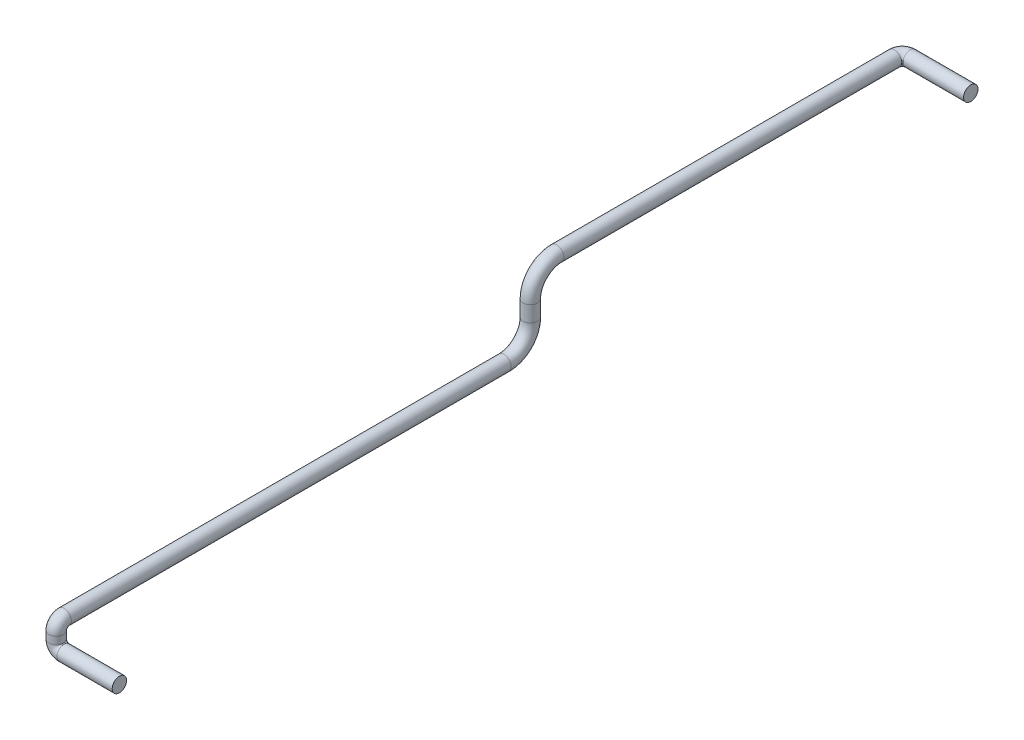
ISO-10303-21;
HEADER;
FILE_DESCRIPTION(('STEP AP214'),'2;1');
FILE_NAME('part.step','',(''),(''),'','','');
FILE_SCHEMA(('AUTOMOTIVE_DESIGN { 1 0 10303 214 1 1 1 1 }'));
ENDSEC;
DATA;
#1=APPLICATION_CONTEXT('core data for automotive mechanical design processes');
#2=APPLICATION_PROTOCOL_DEFINITION('international standard','automotive_design',2000,#1);
#3=PRODUCT_CONTEXT('',#1,'mechanical');
#4=PRODUCT('Part','Part','',(#3));
#5=PRODUCT_RELATED_PRODUCT_CATEGORY('part','',(#4));
#6=PRODUCT_DEFINITION_FORMATION('','',#4);
#7=PRODUCT_DEFINITION_CONTEXT('part definition',#1,'design');
#8=PRODUCT_DEFINITION('design','',#6,#7);
#9=PRODUCT_DEFINITION_SHAPE('','',#8);
#10=(LENGTH_UNIT() NAMED_UNIT(*) SI_UNIT(.MILLI.,.METRE.));
#11=(NAMED_UNIT(*) PLANE_ANGLE_UNIT() SI_UNIT($,.RADIAN.));
#12=(NAMED_UNIT(*) SI_UNIT($,.STERADIAN.) SOLID_ANGLE_UNIT());
#13=UNCERTAINTY_MEASURE_WITH_UNIT(LENGTH_MEASURE(1.E-05),#10,'distance_accuracy_value','');
#14=(GEOMETRIC_REPRESENTATION_CONTEXT(3) GLOBAL_UNCERTAINTY_ASSIGNED_CONTEXT((#13)) GLOBAL_UNIT_ASSIGNED_CONTEXT((#10,
#11,#12)) REPRESENTATION_CONTEXT('',''));
#15=CARTESIAN_POINT('',(0.,0.,0.));
#16=DIRECTION('',(0.,0.,1.));
#17=DIRECTION('',(1.,0.,0.));
#18=AXIS2_PLACEMENT_3D('',#15,#16,#17);
#19=CARTESIAN_POINT('',(0.,0.,0.));
#20=DIRECTION('',(1.,0.,0.));
#21=DIRECTION('',(0.,0.,-1.));
#22=AXIS2_PLACEMENT_3D('',#19,#20,#21);
#23=PLANE('',#22);
#24=CARTESIAN_POINT('',(0.,0.,0.));
#25=DIRECTION('',(1.,0.,0.));
#26=DIRECTION('',(0.,0.,-1.));
#27=AXIS2_PLACEMENT_3D('',#24,#25,#26);
#28=CIRCLE('',#27,13.7);
#29=CARTESIAN_POINT('',(0.,0.,-13.7));
#30=VERTEX_POINT('',#29);
#31=EDGE_CURVE('E49',#30,#30,#28,.T.);
#32=ORIENTED_EDGE('',*,*,#31,.T.);
#33=EDGE_LOOP('',(#32));
#34=FACE_BOUND('',#33,.T.);
#35=ADVANCED_FACE('F37',(#34),#23,.T.);
#36=CARTESIAN_POINT('',(10.0000000000003,174.,-1606.));
#37=DIRECTION('',(-1.,0.,0.));
#38=DIRECTION('',(0.,-1.,0.));
#39=AXIS2_PLACEMENT_3D('',#36,#37,#38);
#40=PLANE('',#39);
#41=CARTESIAN_POINT('',(10.0000000000003,174.,-1606.));
#42=DIRECTION('',(-1.,0.,0.));
#43=DIRECTION('',(0.,-1.,0.));
#44=AXIS2_PLACEMENT_3D('',#41,#42,#43);
#45=CIRCLE('',#44,13.7);
#46=CARTESIAN_POINT('',(10.0000000000003,160.3,-1606.));
#47=VERTEX_POINT('',#46);
#48=EDGE_CURVE('E11',#47,#47,#45,.T.);
#49=ORIENTED_EDGE('',*,*,#48,.F.);
#50=EDGE_LOOP('',(#49));
#51=FACE_BOUND('',#50,.T.);
#52=ADVANCED_FACE('F55',(#51),#40,.F.);
#53=CARTESIAN_POINT('',(0.,0.,0.));
#54=DIRECTION('',(-1.,0.,0.));
#55=DIRECTION('',(0.,0.,1.));
#56=AXIS2_PLACEMENT_3D('',#53,#54,#55);
#57=CYLINDRICAL_SURFACE('',#56,13.7);
#58=CARTESIAN_POINT('',(-105.,0.,0.));
#59=DIRECTION('',(1.,0.,0.));
#60=DIRECTION('',(0.,0.,-1.));
#61=AXIS2_PLACEMENT_3D('',#58,#59,#60);
#62=CIRCLE('',#61,13.7);
#63=CARTESIAN_POINT('',(-105.,-13.7,0.));
#64=VERTEX_POINT('',#63);
#65=EDGE_CURVE('E113',#64,#64,#62,.T.);
#66=ORIENTED_EDGE('',*,*,#65,.T.);
#67=EDGE_LOOP('',(#66));
#68=FACE_BOUND('',#67,.T.);
#69=ORIENTED_EDGE('',*,*,#31,.F.);
#70=EDGE_LOOP('',(#69));
#71=FACE_BOUND('',#70,.T.);
#72=ADVANCED_FACE('F57',(#68,#71),#57,.T.);
#73=CARTESIAN_POINT('',(-105.,15.,0.));
#74=DIRECTION('',(0.,0.,-1.));
#75=DIRECTION('',(-1.,0.,0.));
#76=AXIS2_PLACEMENT_3D('',#73,#74,#75);
#77=TOROIDAL_SURFACE('',#76,15.,13.7);
#78=CARTESIAN_POINT('',(-120.,15.,0.));
#79=DIRECTION('',(0.,-1.,0.));
#80=DIRECTION('',(0.,0.,-1.));
#81=AXIS2_PLACEMENT_3D('',#78,#79,#80);
#82=CIRCLE('',#81,13.7);
#83=CARTESIAN_POINT('',(-133.7,15.,0.));
#84=VERTEX_POINT('',#83);
#85=EDGE_CURVE('E110',#84,#84,#82,.T.);
#86=CARTESIAN_POINT('',(-105.,15.,0.));
#87=DIRECTION('',(0.,0.,-1.));
#88=DIRECTION('',(-1.,0.,0.));
#89=AXIS2_PLACEMENT_3D('',#86,#87,#88);
#90=CIRCLE('',#89,28.7);
#91=EDGE_CURVE('',#64,#84,#90,.T.);
#92=ORIENTED_EDGE('',*,*,#65,.F.);
#93=ORIENTED_EDGE('',*,*,#85,.T.);
#94=ORIENTED_EDGE('',*,*,#91,.T.);
#95=ORIENTED_EDGE('',*,*,#91,.F.);
#96=EDGE_LOOP('',(#92,#94,#93,#95));
#97=FACE_BOUND('',#96,.T.);
#98=ADVANCED_FACE('F62',(#97),#77,.T.);
#99=CARTESIAN_POINT('',(-120.,15.,0.));
#100=DIRECTION('',(0.,1.,0.));
#101=DIRECTION('',(0.,0.,1.));
#102=AXIS2_PLACEMENT_3D('',#99,#100,#101);
#103=CYLINDRICAL_SURFACE('',#102,13.7);
#104=CARTESIAN_POINT('',(-120.,29.,0.));
#105=DIRECTION('',(0.,-1.,0.));
#106=DIRECTION('',(0.,0.,-1.));
#107=AXIS2_PLACEMENT_3D('',#104,#105,#106);
#108=CIRCLE('',#107,13.7);
#109=CARTESIAN_POINT('',(-120.,29.,13.7));
#110=VERTEX_POINT('',#109);
#111=EDGE_CURVE('E115',#110,#110,#108,.T.);
#112=ORIENTED_EDGE('',*,*,#111,.T.);
#113=EDGE_LOOP('',(#112));
#114=FACE_BOUND('',#113,.T.);
#115=ORIENTED_EDGE('',*,*,#85,.F.);
#116=EDGE_LOOP('',(#115));
#117=FACE_BOUND('',#116,.T.);
#118=ADVANCED_FACE('F98',(#114,#117),#103,.T.);
#119=CARTESIAN_POINT('',(-120.,29.,-15.));
#120=DIRECTION('',(-1.,0.,0.));
#121=DIRECTION('',(0.,0.,1.));
#122=AXIS2_PLACEMENT_3D('',#119,#120,#121);
#123=TOROIDAL_SURFACE('',#122,15.,13.7);
#124=CARTESIAN_POINT('',(-120.,44.,-15.));
#125=DIRECTION('',(0.,0.,1.));
#126=DIRECTION('',(0.,-1.,0.));
#127=AXIS2_PLACEMENT_3D('',#124,#125,#126);
#128=CIRCLE('',#127,13.7);
#129=CARTESIAN_POINT('',(-120.,57.7,-15.));
#130=VERTEX_POINT('',#129);
#131=EDGE_CURVE('E121',#130,#130,#128,.T.);
#132=CARTESIAN_POINT('',(-120.,29.,-15.));
#133=DIRECTION('',(-1.,0.,0.));
#134=DIRECTION('',(0.,0.,1.));
#135=AXIS2_PLACEMENT_3D('',#132,#133,#134);
#136=CIRCLE('',#135,28.7);
#137=EDGE_CURVE('',#110,#130,#136,.T.);
#138=ORIENTED_EDGE('',*,*,#111,.F.);
#139=ORIENTED_EDGE('',*,*,#131,.T.);
#140=ORIENTED_EDGE('',*,*,#137,.T.);
#141=ORIENTED_EDGE('',*,*,#137,.F.);
#142=EDGE_LOOP('',(#138,#140,#139,#141));
#143=FACE_BOUND('',#142,.T.);
#144=ADVANCED_FACE('F94',(#143),#123,.T.);
#145=CARTESIAN_POINT('',(-120.,44.,-15.));
#146=DIRECTION('',(0.,0.,-1.));
#147=DIRECTION('',(0.,1.,0.));
#148=AXIS2_PLACEMENT_3D('',#145,#146,#147);
#149=CYLINDRICAL_SURFACE('',#148,13.7);
#150=CARTESIAN_POINT('',(-120.,44.0000000000001,-850.));
#151=DIRECTION('',(0.,0.,1.));
#152=DIRECTION('',(0.,-1.,0.));
#153=AXIS2_PLACEMENT_3D('',#150,#151,#152);
#154=CIRCLE('',#153,13.7);
#155=CARTESIAN_POINT('',(-120.,30.3000000000001,-850.));
#156=VERTEX_POINT('',#155);
#157=EDGE_CURVE('E124',#156,#156,#154,.T.);
#158=ORIENTED_EDGE('',*,*,#157,.T.);
#159=EDGE_LOOP('',(#158));
#160=FACE_BOUND('',#159,.T.);
#161=ORIENTED_EDGE('',*,*,#131,.F.);
#162=EDGE_LOOP('',(#161));
#163=FACE_BOUND('',#162,.T.);
#164=ADVANCED_FACE('F90',(#160,#163),#149,.T.);
#165=CARTESIAN_POINT('',(-120.,94.0000000000001,-850.));
#166=DIRECTION('',(1.,0.,0.));
#167=DIRECTION('',(0.,1.,0.));
#168=AXIS2_PLACEMENT_3D('',#165,#166,#167);
#169=TOROIDAL_SURFACE('',#168,50.,13.7);
#170=CARTESIAN_POINT('',(-120.,94.0000000000001,-900.));
#171=DIRECTION('',(0.,-1.,0.));
#172=DIRECTION('',(0.,0.,-1.));
#173=AXIS2_PLACEMENT_3D('',#170,#171,#172);
#174=CIRCLE('',#173,13.7);
#175=CARTESIAN_POINT('',(-120.,94.0000000000001,-913.7));
#176=VERTEX_POINT('',#175);
#177=EDGE_CURVE('E127',#176,#176,#174,.T.);
#178=CARTESIAN_POINT('',(-120.,94.0000000000001,-850.));
#179=DIRECTION('',(1.,0.,0.));
#180=DIRECTION('',(0.,1.,0.));
#181=AXIS2_PLACEMENT_3D('',#178,#179,#180);
#182=CIRCLE('',#181,63.7);
#183=EDGE_CURVE('',#156,#176,#182,.T.);
#184=ORIENTED_EDGE('',*,*,#157,.F.);
#185=ORIENTED_EDGE('',*,*,#177,.T.);
#186=ORIENTED_EDGE('',*,*,#183,.T.);
#187=ORIENTED_EDGE('',*,*,#183,.F.);
#188=EDGE_LOOP('',(#184,#186,#185,#187));
#189=FACE_BOUND('',#188,.T.);
#190=ADVANCED_FACE('F86',(#189),#169,.T.);
#191=CARTESIAN_POINT('',(-120.,94.0000000000001,-900.));
#192=DIRECTION('',(0.,1.,0.));
#193=DIRECTION('',(0.,0.,1.));
#194=AXIS2_PLACEMENT_3D('',#191,#192,#193);
#195=CYLINDRICAL_SURFACE('',#194,13.7);
#196=CARTESIAN_POINT('',(-120.,124.,-900.));
#197=DIRECTION('',(0.,-1.,0.));
#198=DIRECTION('',(0.,0.,-1.));
#199=AXIS2_PLACEMENT_3D('',#196,#197,#198);
#200=CIRCLE('',#199,13.7);
#201=CARTESIAN_POINT('',(-120.,124.,-886.3));
#202=VERTEX_POINT('',#201);
#203=EDGE_CURVE('E130',#202,#202,#200,.T.);
#204=ORIENTED_EDGE('',*,*,#203,.T.);
#205=EDGE_LOOP('',(#204));
#206=FACE_BOUND('',#205,.T.);
#207=ORIENTED_EDGE('',*,*,#177,.F.);
#208=EDGE_LOOP('',(#207));
#209=FACE_BOUND('',#208,.T.);
#210=ADVANCED_FACE('F82',(#206,#209),#195,.T.);
#211=CARTESIAN_POINT('',(-120.,124.,-950.));
#212=DIRECTION('',(-1.,0.,0.));
#213=DIRECTION('',(0.,0.,1.));
#214=AXIS2_PLACEMENT_3D('',#211,#212,#213);
#215=TOROIDAL_SURFACE('',#214,50.,13.7);
#216=CARTESIAN_POINT('',(-120.,174.,-950.));
#217=DIRECTION('',(0.,0.,1.));
#218=DIRECTION('',(0.,-1.,0.));
#219=AXIS2_PLACEMENT_3D('',#216,#217,#218);
#220=CIRCLE('',#219,13.7);
#221=CARTESIAN_POINT('',(-120.,187.7,-950.));
#222=VERTEX_POINT('',#221);
#223=EDGE_CURVE('E133',#222,#222,#220,.T.);
#224=CARTESIAN_POINT('',(-120.,124.,-950.));
#225=DIRECTION('',(-1.,0.,0.));
#226=DIRECTION('',(0.,0.,1.));
#227=AXIS2_PLACEMENT_3D('',#224,#225,#226);
#228=CIRCLE('',#227,63.7);
#229=EDGE_CURVE('',#202,#222,#228,.T.);
#230=ORIENTED_EDGE('',*,*,#203,.F.);
#231=ORIENTED_EDGE('',*,*,#223,.T.);
#232=ORIENTED_EDGE('',*,*,#229,.T.);
#233=ORIENTED_EDGE('',*,*,#229,.F.);
#234=EDGE_LOOP('',(#230,#232,#231,#233));
#235=FACE_BOUND('',#234,.T.);
#236=ADVANCED_FACE('F78',(#235),#215,.T.);
#237=CARTESIAN_POINT('',(-120.,174.,-950.));
#238=DIRECTION('',(0.,0.,-1.));
#239=DIRECTION('',(-1.,0.,0.));
#240=AXIS2_PLACEMENT_3D('',#237,#238,#239);
#241=CYLINDRICAL_SURFACE('',#240,13.7);
#242=CARTESIAN_POINT('',(-120.,174.,-1591.));
#243=DIRECTION('',(0.,0.,1.));
#244=DIRECTION('',(0.,-1.,0.));
#245=AXIS2_PLACEMENT_3D('',#242,#243,#244);
#246=CIRCLE('',#245,13.7);
#247=CARTESIAN_POINT('',(-133.7,174.,-1591.));
#248=VERTEX_POINT('',#247);
#249=EDGE_CURVE('E136',#248,#248,#246,.T.);
#250=ORIENTED_EDGE('',*,*,#249,.T.);
#251=EDGE_LOOP('',(#250));
#252=FACE_BOUND('',#251,.T.);
#253=ORIENTED_EDGE('',*,*,#223,.F.);
#254=EDGE_LOOP('',(#253));
#255=FACE_BOUND('',#254,.T.);
#256=ADVANCED_FACE('F72',(#252,#255),#241,.T.);
#257=CARTESIAN_POINT('',(-105.,174.,-1591.));
#258=DIRECTION('',(0.,-1.,0.));
#259=DIRECTION('',(1.,0.,0.));
#260=AXIS2_PLACEMENT_3D('',#257,#258,#259);
#261=TOROIDAL_SURFACE('',#260,14.9999999999999,13.7);
#262=CARTESIAN_POINT('',(-105.,174.,-1606.));
#263=DIRECTION('',(-1.,0.,0.));
#264=DIRECTION('',(0.,-1.,0.));
#265=AXIS2_PLACEMENT_3D('',#262,#263,#264);
#266=CIRCLE('',#265,13.7);
#267=CARTESIAN_POINT('',(-105.,174.,-1619.7));
#268=VERTEX_POINT('',#267);
#269=EDGE_CURVE('E44',#268,#268,#266,.T.);
#270=CARTESIAN_POINT('',(-105.,174.,-1591.));
#271=DIRECTION('',(0.,-1.,0.));
#272=DIRECTION('',(1.,0.,0.));
#273=AXIS2_PLACEMENT_3D('',#270,#271,#272);
#274=CIRCLE('',#273,28.6999999999999);
#275=EDGE_CURVE('',#248,#268,#274,.T.);
#276=ORIENTED_EDGE('',*,*,#249,.F.);
#277=ORIENTED_EDGE('',*,*,#269,.T.);
#278=ORIENTED_EDGE('',*,*,#275,.T.);
#279=ORIENTED_EDGE('',*,*,#275,.F.);
#280=EDGE_LOOP('',(#276,#278,#277,#279));
#281=FACE_BOUND('',#280,.T.);
#282=ADVANCED_FACE('F68',(#281),#261,.T.);
#283=CARTESIAN_POINT('',(-105.,174.,-1606.));
#284=DIRECTION('',(1.,0.,0.));
#285=DIRECTION('',(0.,0.,-1.));
#286=AXIS2_PLACEMENT_3D('',#283,#284,#285);
#287=CYLINDRICAL_SURFACE('',#286,13.7);
#288=ORIENTED_EDGE('',*,*,#48,.T.);
#289=EDGE_LOOP('',(#288));
#290=FACE_BOUND('',#289,.T.);
#291=ORIENTED_EDGE('',*,*,#269,.F.);
#292=EDGE_LOOP('',(#291));
#293=FACE_BOUND('',#292,.T.);
#294=ADVANCED_FACE('F52',(#290,#293),#287,.T.);
#295=CLOSED_SHELL('',(#35,#52,#72,#98,#118,#144,#164,#190,#210,#236,#256,#282,#294));
#296=MANIFOLD_SOLID_BREP('B2',#295);
#297=ADVANCED_BREP_SHAPE_REPRESENTATION('',(#18,#296),#14);
#298=SHAPE_DEFINITION_REPRESENTATION(#9,#297);
ENDSEC;
END-ISO-10303-21;
